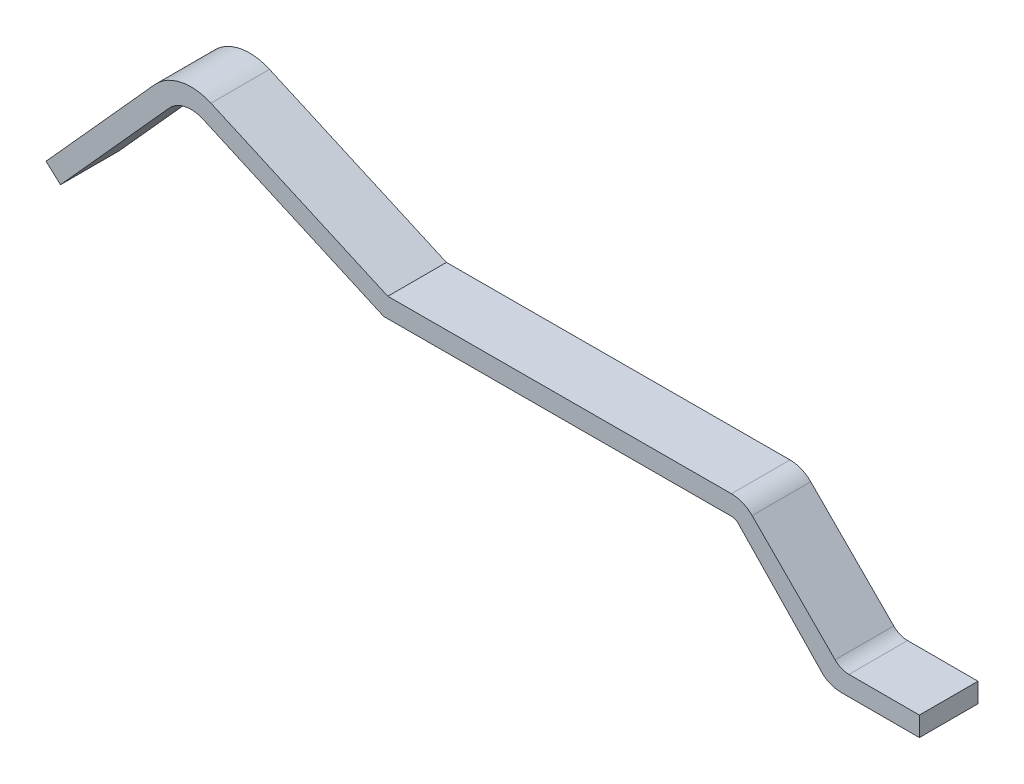
ISO-10303-21;
HEADER;
FILE_DESCRIPTION(('STEP AP214'),'2;1');
FILE_NAME('part.step','',(''),(''),'','','');
FILE_SCHEMA(('AUTOMOTIVE_DESIGN { 1 0 10303 214 1 1 1 1 }'));
ENDSEC;
DATA;
#1=APPLICATION_CONTEXT('core data for automotive mechanical design processes');
#2=APPLICATION_PROTOCOL_DEFINITION('international standard','automotive_design',2000,#1);
#3=PRODUCT_CONTEXT('',#1,'mechanical');
#4=PRODUCT('Part','Part','',(#3));
#5=PRODUCT_RELATED_PRODUCT_CATEGORY('part','',(#4));
#6=PRODUCT_DEFINITION_FORMATION('','',#4);
#7=PRODUCT_DEFINITION_CONTEXT('part definition',#1,'design');
#8=PRODUCT_DEFINITION('design','',#6,#7);
#9=PRODUCT_DEFINITION_SHAPE('','',#8);
#10=(LENGTH_UNIT() NAMED_UNIT(*) SI_UNIT(.MILLI.,.METRE.));
#11=(NAMED_UNIT(*) PLANE_ANGLE_UNIT() SI_UNIT($,.RADIAN.));
#12=(NAMED_UNIT(*) SI_UNIT($,.STERADIAN.) SOLID_ANGLE_UNIT());
#13=UNCERTAINTY_MEASURE_WITH_UNIT(LENGTH_MEASURE(1.E-05),#10,'distance_accuracy_value','');
#14=(GEOMETRIC_REPRESENTATION_CONTEXT(3) GLOBAL_UNCERTAINTY_ASSIGNED_CONTEXT((#13)) GLOBAL_UNIT_ASSIGNED_CONTEXT((#10,
#11,#12)) REPRESENTATION_CONTEXT('',''));
#15=CARTESIAN_POINT('',(0.,0.,0.));
#16=DIRECTION('',(0.,0.,1.));
#17=DIRECTION('',(1.,0.,0.));
#18=AXIS2_PLACEMENT_3D('',#15,#16,#17);
#19=CARTESIAN_POINT('',(17.1707476581065,0.197947805161229,0.3));
#20=DIRECTION('',(0.,-1.,0.));
#21=DIRECTION('',(1.,0.,0.));
#22=AXIS2_PLACEMENT_3D('',#19,#20,#21);
#23=PLANE('',#22);
#24=DIRECTION('',(0.,0.,-1.));
#25=VECTOR('',#24,1.);
#26=CARTESIAN_POINT('',(17.1707476581065,0.197947805161225,0.3));
#27=LINE('',#26,#25);
#28=CARTESIAN_POINT('',(17.1707476581065,0.197947805161225,-0.3));
#29=VERTEX_POINT('',#28);
#30=CARTESIAN_POINT('',(17.1707476581065,0.197947805161225,0.3));
#31=VERTEX_POINT('',#30);
#32=EDGE_CURVE('E232',#29,#31,#27,.F.);
#33=ORIENTED_EDGE('',*,*,#32,.T.);
#34=DIRECTION('',(-1.,0.,0.));
#35=VECTOR('',#34,1.);
#36=CARTESIAN_POINT('',(17.0917527563786,0.197947805161225,0.3));
#37=LINE('',#36,#35);
#38=CARTESIAN_POINT('',(17.8917527563786,0.197947805161227,0.3));
#39=VERTEX_POINT('',#38);
#40=EDGE_CURVE('E188',#31,#39,#37,.F.);
#41=ORIENTED_EDGE('',*,*,#40,.T.);
#42=DIRECTION('',(0.,0.,1.));
#43=VECTOR('',#42,1.);
#44=CARTESIAN_POINT('',(17.8917527563786,0.197947805161229,0.3));
#45=LINE('',#44,#43);
#46=CARTESIAN_POINT('',(17.8917527563786,0.197947805161226,-0.3));
#47=VERTEX_POINT('',#46);
#48=EDGE_CURVE('E276',#39,#47,#45,.F.);
#49=ORIENTED_EDGE('',*,*,#48,.T.);
#50=DIRECTION('',(-1.,0.,0.));
#51=VECTOR('',#50,1.);
#52=CARTESIAN_POINT('',(17.0917527563786,0.197947805161225,-0.3));
#53=LINE('',#52,#51);
#54=EDGE_CURVE('E271',#29,#47,#53,.F.);
#55=ORIENTED_EDGE('',*,*,#54,.F.);
#56=EDGE_LOOP('',(#33,#41,#49,#55));
#57=FACE_BOUND('',#56,.T.);
#58=ADVANCED_FACE('F17',(#57),#23,.F.);
#59=CARTESIAN_POINT('',(17.8917527563786,0.197947805161229,0.3));
#60=DIRECTION('',(-1.,0.,0.));
#61=DIRECTION('',(0.,0.,1.));
#62=AXIS2_PLACEMENT_3D('',#59,#60,#61);
#63=PLANE('',#62);
#64=ORIENTED_EDGE('',*,*,#48,.F.);
#65=DIRECTION('',(0.,1.,0.));
#66=VECTOR('',#65,1.);
#67=CARTESIAN_POINT('',(17.8917527563786,0.297947805161533,0.3));
#68=LINE('',#67,#66);
#69=CARTESIAN_POINT('',(17.8917527563786,-0.00205219483882492,0.3));
#70=VERTEX_POINT('',#69);
#71=EDGE_CURVE('E226',#39,#70,#68,.F.);
#72=ORIENTED_EDGE('',*,*,#71,.T.);
#73=DIRECTION('',(0.,0.,1.));
#74=VECTOR('',#73,1.);
#75=CARTESIAN_POINT('',(17.8917527563786,-0.00205219483882491,0.3));
#76=LINE('',#75,#74);
#77=CARTESIAN_POINT('',(17.8917527563786,-0.00205219483882492,-0.3));
#78=VERTEX_POINT('',#77);
#79=EDGE_CURVE('E97',#70,#78,#76,.F.);
#80=ORIENTED_EDGE('',*,*,#79,.T.);
#81=DIRECTION('',(0.,1.,0.));
#82=VECTOR('',#81,1.);
#83=CARTESIAN_POINT('',(17.8917527563786,0.297947805161533,-0.3));
#84=LINE('',#83,#82);
#85=EDGE_CURVE('E279',#47,#78,#84,.F.);
#86=ORIENTED_EDGE('',*,*,#85,.F.);
#87=EDGE_LOOP('',(#64,#72,#80,#86));
#88=FACE_BOUND('',#87,.T.);
#89=ADVANCED_FACE('F343',(#88),#63,.F.);
#90=CARTESIAN_POINT('',(17.8917527563786,-0.00205219483882491,0.3));
#91=DIRECTION('',(0.,1.,0.));
#92=DIRECTION('',(-1.,0.,0.));
#93=AXIS2_PLACEMENT_3D('',#90,#91,#92);
#94=PLANE('',#93);
#95=ORIENTED_EDGE('',*,*,#79,.F.);
#96=DIRECTION('',(-1.,0.,0.));
#97=VECTOR('',#96,1.);
#98=CARTESIAN_POINT('',(17.0917527563786,-0.00205219483882492,0.3));
#99=LINE('',#98,#97);
#100=CARTESIAN_POINT('',(17.0917527563786,-0.00205219483882557,0.3));
#101=VERTEX_POINT('',#100);
#102=EDGE_CURVE('E224',#70,#101,#99,.T.);
#103=ORIENTED_EDGE('',*,*,#102,.T.);
#104=DIRECTION('',(0.,0.,-1.));
#105=VECTOR('',#104,1.);
#106=CARTESIAN_POINT('',(17.0917527563786,-0.00205219483882623,0.3));
#107=LINE('',#106,#105);
#108=CARTESIAN_POINT('',(17.0917527563786,-0.00205219483882557,-0.3));
#109=VERTEX_POINT('',#108);
#110=EDGE_CURVE('E87',#109,#101,#107,.F.);
#111=ORIENTED_EDGE('',*,*,#110,.F.);
#112=DIRECTION('',(-1.,0.,0.));
#113=VECTOR('',#112,1.);
#114=CARTESIAN_POINT('',(17.0917527563786,-0.00205219483882492,-0.3));
#115=LINE('',#114,#113);
#116=EDGE_CURVE('E282',#78,#109,#115,.T.);
#117=ORIENTED_EDGE('',*,*,#116,.F.);
#118=EDGE_LOOP('',(#95,#103,#111,#117));
#119=FACE_BOUND('',#118,.T.);
#120=ADVANCED_FACE('F344',(#119),#94,.F.);
#121=CARTESIAN_POINT('',(17.0917527563786,0.297947805161533,0.3));
#122=DIRECTION('',(0.,0.,-1.));
#123=DIRECTION('',(-1.,0.,0.));
#124=AXIS2_PLACEMENT_3D('',#121,#122,#123);
#125=CYLINDRICAL_SURFACE('',#124,0.300000000000359);
#126=CARTESIAN_POINT('',(17.0917527563786,0.297947805161533,0.3));
#127=DIRECTION('',(0.,0.,-1.));
#128=DIRECTION('',(-1.,0.,0.));
#129=AXIS2_PLACEMENT_3D('',#126,#127,#128);
#130=CIRCLE('',#129,0.300000000000359);
#131=CARTESIAN_POINT('',(16.9117527563786,0.0579478051610852,0.3));
#132=VERTEX_POINT('',#131);
#133=EDGE_CURVE('E20',#101,#132,#130,.T.);
#134=ORIENTED_EDGE('',*,*,#133,.T.);
#135=DIRECTION('',(0.,0.,1.));
#136=VECTOR('',#135,1.);
#137=CARTESIAN_POINT('',(16.9117527563786,0.0579478051610878,0.3));
#138=LINE('',#137,#136);
#139=CARTESIAN_POINT('',(16.9117527563786,0.0579478051610852,-0.3));
#140=VERTEX_POINT('',#139);
#141=EDGE_CURVE('E160',#132,#140,#138,.F.);
#142=ORIENTED_EDGE('',*,*,#141,.T.);
#143=CARTESIAN_POINT('',(17.0917527563786,0.297947805161533,-0.3));
#144=DIRECTION('',(0.,0.,-1.));
#145=DIRECTION('',(-1.,0.,0.));
#146=AXIS2_PLACEMENT_3D('',#143,#144,#145);
#147=CIRCLE('',#146,0.300000000000359);
#148=EDGE_CURVE('E306',#109,#140,#147,.T.);
#149=ORIENTED_EDGE('',*,*,#148,.F.);
#150=ORIENTED_EDGE('',*,*,#110,.T.);
#151=EDGE_LOOP('',(#134,#142,#149,#150));
#152=FACE_BOUND('',#151,.T.);
#153=ADVANCED_FACE('F346',(#152),#125,.T.);
#154=CARTESIAN_POINT('',(16.9117527563786,0.0579478051610878,0.3));
#155=DIRECTION('',(0.72171309209664,0.692192323488427,0.));
#156=DIRECTION('',(-0.692192323488427,0.72171309209664,0.));
#157=AXIS2_PLACEMENT_3D('',#154,#155,#156);
#158=PLANE('',#157);
#159=ORIENTED_EDGE('',*,*,#141,.F.);
#160=DIRECTION('',(-0.692192323488427,0.72171309209664,0.));
#161=VECTOR('',#160,1.);
#162=CARTESIAN_POINT('',(16.9117527563786,0.0579478051610877,0.3));
#163=LINE('',#162,#161);
#164=CARTESIAN_POINT('',(16.0381993657855,0.968756690557452,0.3));
#165=VERTEX_POINT('',#164);
#166=EDGE_CURVE('E172',#132,#165,#163,.T.);
#167=ORIENTED_EDGE('',*,*,#166,.T.);
#168=DIRECTION('',(0.,0.,-1.));
#169=VECTOR('',#168,1.);
#170=CARTESIAN_POINT('',(16.0381993657854,0.9687566905576,0.3));
#171=LINE('',#170,#169);
#172=CARTESIAN_POINT('',(16.0381993657855,0.968756690557452,-0.3));
#173=VERTEX_POINT('',#172);
#174=EDGE_CURVE('E268',#165,#173,#171,.T.);
#175=ORIENTED_EDGE('',*,*,#174,.T.);
#176=DIRECTION('',(-0.692192323488427,0.72171309209664,0.));
#177=VECTOR('',#176,1.);
#178=CARTESIAN_POINT('',(16.9117527563786,0.0579478051610877,-0.3));
#179=LINE('',#178,#177);
#180=EDGE_CURVE('E305',#140,#173,#179,.T.);
#181=ORIENTED_EDGE('',*,*,#180,.F.);
#182=EDGE_LOOP('',(#159,#167,#175,#181));
#183=FACE_BOUND('',#182,.T.);
#184=ADVANCED_FACE('F349',(#183),#158,.F.);
#185=CARTESIAN_POINT('',(12.407488687666,0.99,0.3));
#186=DIRECTION('',(0.40673664307565,0.913545457642668,0.));
#187=DIRECTION('',(-0.913545457642668,0.40673664307565,0.));
#188=AXIS2_PLACEMENT_3D('',#185,#186,#187);
#189=PLANE('',#188);
#190=DIRECTION('',(0.,0.,1.));
#191=VECTOR('',#190,1.);
#192=CARTESIAN_POINT('',(12.407488687666,0.99,0.3));
#193=LINE('',#192,#191);
#194=CARTESIAN_POINT('',(12.407488687666,0.99,0.3));
#195=VERTEX_POINT('',#194);
#196=CARTESIAN_POINT('',(12.407488687666,0.99,-0.3));
#197=VERTEX_POINT('',#196);
#198=EDGE_CURVE('E151',#195,#197,#193,.F.);
#199=ORIENTED_EDGE('',*,*,#198,.F.);
#200=DIRECTION('',(-0.913545457642668,0.40673664307565,0.));
#201=VECTOR('',#200,1.);
#202=CARTESIAN_POINT('',(12.407488687666,0.99,0.3));
#203=LINE('',#202,#201);
#204=CARTESIAN_POINT('',(10.5579715524435,1.81345808257036,0.3));
#205=VERTEX_POINT('',#204);
#206=EDGE_CURVE('E155',#195,#205,#203,.T.);
#207=ORIENTED_EDGE('',*,*,#206,.T.);
#208=DIRECTION('',(0.,0.,-1.));
#209=VECTOR('',#208,1.);
#210=CARTESIAN_POINT('',(10.5579715524435,1.81345808257035,0.3));
#211=LINE('',#210,#209);
#212=CARTESIAN_POINT('',(10.5579715524435,1.81345808257036,-0.3));
#213=VERTEX_POINT('',#212);
#214=EDGE_CURVE('E159',#205,#213,#211,.T.);
#215=ORIENTED_EDGE('',*,*,#214,.T.);
#216=DIRECTION('',(-0.913545457642668,0.40673664307565,0.));
#217=VECTOR('',#216,1.);
#218=CARTESIAN_POINT('',(12.407488687666,0.99,-0.3));
#219=LINE('',#218,#217);
#220=EDGE_CURVE('E156',#197,#213,#219,.T.);
#221=ORIENTED_EDGE('',*,*,#220,.F.);
#222=EDGE_LOOP('',(#199,#207,#215,#221));
#223=FACE_BOUND('',#222,.T.);
#224=ADVANCED_FACE('F153',(#223),#189,.F.);
#225=CARTESIAN_POINT('',(10.4359505595208,1.53939444527741,0.3));
#226=DIRECTION('',(0.,0.,-1.));
#227=DIRECTION('',(-1.,0.,0.));
#228=AXIS2_PLACEMENT_3D('',#225,#226,#227);
#229=CYLINDRICAL_SURFACE('',#228,0.300000000000163);
#230=ORIENTED_EDGE('',*,*,#214,.F.);
#231=CARTESIAN_POINT('',(10.4359505595208,1.53939444527741,0.3));
#232=DIRECTION('',(0.,0.,-1.));
#233=DIRECTION('',(-1.,0.,0.));
#234=AXIS2_PLACEMENT_3D('',#231,#232,#233);
#235=CIRCLE('',#234,0.300000000000163);
#236=CARTESIAN_POINT('',(10.2130071118774,1.74013362718514,0.3));
#237=VERTEX_POINT('',#236);
#238=EDGE_CURVE('E171',#205,#237,#235,.F.);
#239=ORIENTED_EDGE('',*,*,#238,.T.);
#240=DIRECTION('',(0.,0.,1.));
#241=VECTOR('',#240,1.);
#242=CARTESIAN_POINT('',(10.2130071118774,1.74013362718514,0.3));
#243=LINE('',#242,#241);
#244=CARTESIAN_POINT('',(10.2130071118774,1.74013362718514,-0.3));
#245=VERTEX_POINT('',#244);
#246=EDGE_CURVE('E261',#237,#245,#243,.F.);
#247=ORIENTED_EDGE('',*,*,#246,.T.);
#248=CARTESIAN_POINT('',(10.4359505595208,1.53939444527741,-0.3));
#249=DIRECTION('',(0.,0.,-1.));
#250=DIRECTION('',(-1.,0.,0.));
#251=AXIS2_PLACEMENT_3D('',#248,#249,#250);
#252=CIRCLE('',#251,0.300000000000163);
#253=EDGE_CURVE('E134',#213,#245,#252,.F.);
#254=ORIENTED_EDGE('',*,*,#253,.F.);
#255=EDGE_LOOP('',(#230,#239,#247,#254));
#256=FACE_BOUND('',#255,.T.);
#257=ADVANCED_FACE('F315',(#256),#229,.F.);
#258=CARTESIAN_POINT('',(10.2130071118774,1.74013362718514,0.3));
#259=DIRECTION('',(-0.743144825477495,0.669130606358746,0.));
#260=DIRECTION('',(-0.669130606358746,-0.743144825477495,0.));
#261=AXIS2_PLACEMENT_3D('',#258,#259,#260);
#262=PLANE('',#261);
#263=ORIENTED_EDGE('',*,*,#246,.F.);
#264=DIRECTION('',(-0.669130606358745,-0.743144825477496,0.));
#265=VECTOR('',#264,1.);
#266=CARTESIAN_POINT('',(10.2130071118774,1.74013362718514,0.3));
#267=LINE('',#266,#265);
#268=CARTESIAN_POINT('',(9.09953182556442,0.503494039252559,0.3));
#269=VERTEX_POINT('',#268);
#270=EDGE_CURVE('E216',#237,#269,#267,.T.);
#271=ORIENTED_EDGE('',*,*,#270,.T.);
#272=DIRECTION('',(0.,0.,1.));
#273=VECTOR('',#272,1.);
#274=CARTESIAN_POINT('',(9.09953182556442,0.50349403925256,0.3));
#275=LINE('',#274,#273);
#276=CARTESIAN_POINT('',(9.09953182556442,0.503494039252559,-0.3));
#277=VERTEX_POINT('',#276);
#278=EDGE_CURVE('E252',#269,#277,#275,.F.);
#279=ORIENTED_EDGE('',*,*,#278,.T.);
#280=DIRECTION('',(-0.669130606358745,-0.743144825477496,0.));
#281=VECTOR('',#280,1.);
#282=CARTESIAN_POINT('',(10.2130071118774,1.74013362718514,-0.3));
#283=LINE('',#282,#281);
#284=EDGE_CURVE('E139',#245,#277,#283,.T.);
#285=ORIENTED_EDGE('',*,*,#284,.F.);
#286=EDGE_LOOP('',(#263,#271,#279,#285));
#287=FACE_BOUND('',#286,.T.);
#288=ADVANCED_FACE('F317',(#287),#262,.F.);
#289=CARTESIAN_POINT('',(9.09953182556442,0.50349403925256,0.3));
#290=DIRECTION('',(0.669130606358746,0.743144825477495,0.));
#291=DIRECTION('',(-0.743144825477495,0.669130606358746,0.));
#292=AXIS2_PLACEMENT_3D('',#289,#290,#291);
#293=PLANE('',#292);
#294=ORIENTED_EDGE('',*,*,#278,.F.);
#295=DIRECTION('',(-0.743144825477496,0.669130606358746,0.));
#296=VECTOR('',#295,1.);
#297=CARTESIAN_POINT('',(9.09953182556442,0.50349403925256,0.3));
#298=LINE('',#297,#296);
#299=CARTESIAN_POINT('',(8.95090286046869,0.63732016052452,0.3));
#300=VERTEX_POINT('',#299);
#301=EDGE_CURVE('E213',#269,#300,#298,.T.);
#302=ORIENTED_EDGE('',*,*,#301,.T.);
#303=DIRECTION('',(0.,0.,1.));
#304=VECTOR('',#303,1.);
#305=CARTESIAN_POINT('',(8.95090286046869,0.63732016052452,0.3));
#306=LINE('',#305,#304);
#307=CARTESIAN_POINT('',(8.95090286046869,0.63732016052452,-0.3));
#308=VERTEX_POINT('',#307);
#309=EDGE_CURVE('E249',#300,#308,#306,.F.);
#310=ORIENTED_EDGE('',*,*,#309,.T.);
#311=DIRECTION('',(-0.743144825477496,0.669130606358746,0.));
#312=VECTOR('',#311,1.);
#313=CARTESIAN_POINT('',(9.09953182556442,0.50349403925256,-0.3));
#314=LINE('',#313,#312);
#315=EDGE_CURVE('E255',#277,#308,#314,.T.);
#316=ORIENTED_EDGE('',*,*,#315,.F.);
#317=EDGE_LOOP('',(#294,#302,#310,#316));
#318=FACE_BOUND('',#317,.T.);
#319=ADVANCED_FACE('F387',(#318),#293,.F.);
#320=CARTESIAN_POINT('',(8.95090286046869,0.63732016052452,0.3));
#321=DIRECTION('',(0.743144825477361,-0.669130606358895,0.));
#322=DIRECTION('',(0.669130606358895,0.743144825477361,0.));
#323=AXIS2_PLACEMENT_3D('',#320,#321,#322);
#324=PLANE('',#323);
#325=ORIENTED_EDGE('',*,*,#309,.F.);
#326=DIRECTION('',(0.669130606358895,0.743144825477361,0.));
#327=VECTOR('',#326,1.);
#328=CARTESIAN_POINT('',(8.95090286046869,0.63732016052452,0.3));
#329=LINE('',#328,#327);
#330=CARTESIAN_POINT('',(10.064378146782,1.87395974845693,0.3));
#331=VERTEX_POINT('',#330);
#332=EDGE_CURVE('E210',#300,#331,#329,.T.);
#333=ORIENTED_EDGE('',*,*,#332,.T.);
#334=DIRECTION('',(0.,0.,-1.));
#335=VECTOR('',#334,1.);
#336=CARTESIAN_POINT('',(10.0643781467819,1.87395974845692,0.3));
#337=LINE('',#336,#335);
#338=CARTESIAN_POINT('',(10.064378146782,1.87395974845693,-0.3));
#339=VERTEX_POINT('',#338);
#340=EDGE_CURVE('E247',#339,#331,#337,.F.);
#341=ORIENTED_EDGE('',*,*,#340,.F.);
#342=DIRECTION('',(0.669130606358895,0.743144825477361,0.));
#343=VECTOR('',#342,1.);
#344=CARTESIAN_POINT('',(8.95090286046869,0.63732016052452,-0.3));
#345=LINE('',#344,#343);
#346=EDGE_CURVE('E257',#308,#339,#345,.T.);
#347=ORIENTED_EDGE('',*,*,#346,.F.);
#348=EDGE_LOOP('',(#325,#333,#341,#347));
#349=FACE_BOUND('',#348,.T.);
#350=ADVANCED_FACE('F384',(#349),#324,.F.);
#351=CARTESIAN_POINT('',(10.4359505595208,1.53939444527736,0.3));
#352=DIRECTION('',(0.,0.,-1.));
#353=DIRECTION('',(-1.,0.,0.));
#354=AXIS2_PLACEMENT_3D('',#351,#352,#353);
#355=CYLINDRICAL_SURFACE('',#354,0.50000000000019);
#356=CARTESIAN_POINT('',(10.4359505595208,1.53939444527736,0.3));
#357=DIRECTION('',(0.,0.,-1.));
#358=DIRECTION('',(-1.,0.,0.));
#359=AXIS2_PLACEMENT_3D('',#356,#357,#358);
#360=CIRCLE('',#359,0.50000000000019);
#361=CARTESIAN_POINT('',(10.6393188810587,1.99616717409889,0.3));
#362=VERTEX_POINT('',#361);
#363=EDGE_CURVE('E207',#331,#362,#360,.T.);
#364=ORIENTED_EDGE('',*,*,#363,.T.);
#365=DIRECTION('',(0.,0.,1.));
#366=VECTOR('',#365,1.);
#367=CARTESIAN_POINT('',(10.6393188810586,1.9961671740989,0.3));
#368=LINE('',#367,#366);
#369=CARTESIAN_POINT('',(10.6393188810587,1.99616717409889,-0.3));
#370=VERTEX_POINT('',#369);
#371=EDGE_CURVE('E242',#362,#370,#368,.F.);
#372=ORIENTED_EDGE('',*,*,#371,.T.);
#373=CARTESIAN_POINT('',(10.4359505595208,1.53939444527736,-0.3));
#374=DIRECTION('',(0.,0.,-1.));
#375=DIRECTION('',(-1.,0.,0.));
#376=AXIS2_PLACEMENT_3D('',#373,#374,#375);
#377=CIRCLE('',#376,0.50000000000019);
#378=EDGE_CURVE('E300',#339,#370,#377,.T.);
#379=ORIENTED_EDGE('',*,*,#378,.F.);
#380=ORIENTED_EDGE('',*,*,#340,.T.);
#381=EDGE_LOOP('',(#364,#372,#379,#380));
#382=FACE_BOUND('',#381,.T.);
#383=ADVANCED_FACE('F378',(#382),#355,.T.);
#384=CARTESIAN_POINT('',(10.6393188810586,1.9961671740989,0.3));
#385=DIRECTION('',(-0.40673664307565,-0.913545457642668,0.));
#386=DIRECTION('',(0.913545457642668,-0.40673664307565,0.));
#387=AXIS2_PLACEMENT_3D('',#384,#385,#386);
#388=PLANE('',#387);
#389=ORIENTED_EDGE('',*,*,#371,.F.);
#390=DIRECTION('',(0.913545457642668,-0.406736643075651,0.));
#391=VECTOR('',#390,1.);
#392=CARTESIAN_POINT('',(10.6393188810586,1.9961671740989,0.3));
#393=LINE('',#392,#391);
#394=CARTESIAN_POINT('',(12.45,1.19000000000001,0.3));
#395=VERTEX_POINT('',#394);
#396=EDGE_CURVE('E202',#362,#395,#393,.T.);
#397=ORIENTED_EDGE('',*,*,#396,.T.);
#398=DIRECTION('',(0.,0.,1.));
#399=VECTOR('',#398,1.);
#400=CARTESIAN_POINT('',(12.45,1.19000000000001,0.3));
#401=LINE('',#400,#399);
#402=CARTESIAN_POINT('',(12.45,1.19000000000001,-0.3));
#403=VERTEX_POINT('',#402);
#404=EDGE_CURVE('E239',#395,#403,#401,.F.);
#405=ORIENTED_EDGE('',*,*,#404,.T.);
#406=DIRECTION('',(0.913545457642668,-0.406736643075651,0.));
#407=VECTOR('',#406,1.);
#408=CARTESIAN_POINT('',(10.6393188810586,1.9961671740989,-0.3));
#409=LINE('',#408,#407);
#410=EDGE_CURVE('E302',#370,#403,#409,.T.);
#411=ORIENTED_EDGE('',*,*,#410,.F.);
#412=EDGE_LOOP('',(#389,#397,#405,#411));
#413=FACE_BOUND('',#412,.T.);
#414=ADVANCED_FACE('F373',(#413),#388,.F.);
#415=CARTESIAN_POINT('',(12.45,1.19000000000001,0.3));
#416=DIRECTION('',(0.00225950545359394,-0.999997447314295,0.));
#417=DIRECTION('',(0.999997447314295,0.00225950545359394,0.));
#418=AXIS2_PLACEMENT_3D('',#415,#416,#417);
#419=PLANE('',#418);
#420=ORIENTED_EDGE('',*,*,#404,.F.);
#421=DIRECTION('',(0.999997447314295,0.00225950545359387,0.));
#422=VECTOR('',#421,1.);
#423=CARTESIAN_POINT('',(12.45,1.19000000000001,0.3));
#424=LINE('',#423,#422);
#425=CARTESIAN_POINT('',(15.9674886876667,1.197947805161,0.3));
#426=VERTEX_POINT('',#425);
#427=EDGE_CURVE('E199',#395,#426,#424,.T.);
#428=ORIENTED_EDGE('',*,*,#427,.T.);
#429=DIRECTION('',(0.,0.,-1.));
#430=VECTOR('',#429,1.);
#431=CARTESIAN_POINT('',(15.9674886876667,1.197947805161,0.3));
#432=LINE('',#431,#430);
#433=CARTESIAN_POINT('',(15.9674886876667,1.197947805161,-0.3));
#434=VERTEX_POINT('',#433);
#435=EDGE_CURVE('E237',#434,#426,#432,.F.);
#436=ORIENTED_EDGE('',*,*,#435,.F.);
#437=DIRECTION('',(0.999997447314295,0.00225950545359387,0.));
#438=VECTOR('',#437,1.);
#439=CARTESIAN_POINT('',(12.45,1.19000000000001,-0.3));
#440=LINE('',#439,#438);
#441=EDGE_CURVE('E299',#403,#434,#440,.T.);
#442=ORIENTED_EDGE('',*,*,#441,.F.);
#443=EDGE_LOOP('',(#420,#428,#436,#442));
#444=FACE_BOUND('',#443,.T.);
#445=ADVANCED_FACE('F368',(#444),#419,.F.);
#446=CARTESIAN_POINT('',(15.968162863443,0.899575409463471,0.3));
#447=DIRECTION('',(0.,0.,-1.));
#448=DIRECTION('',(-1.,0.,0.));
#449=AXIS2_PLACEMENT_3D('',#446,#447,#448);
#450=CYLINDRICAL_SURFACE('',#449,0.298373157350418);
#451=CARTESIAN_POINT('',(15.968162863443,0.899575409463471,0.3));
#452=DIRECTION('',(0.,0.,-1.));
#453=DIRECTION('',(-1.,0.,0.));
#454=AXIS2_PLACEMENT_3D('',#451,#452,#453);
#455=CIRCLE('',#454,0.298373157350418);
#456=CARTESIAN_POINT('',(16.1796207220227,1.11007983951695,0.3));
#457=VERTEX_POINT('',#456);
#458=EDGE_CURVE('E198',#426,#457,#455,.T.);
#459=ORIENTED_EDGE('',*,*,#458,.T.);
#460=DIRECTION('',(0.,0.,1.));
#461=VECTOR('',#460,1.);
#462=CARTESIAN_POINT('',(16.1796207220227,1.11007983951695,0.3));
#463=LINE('',#462,#461);
#464=CARTESIAN_POINT('',(16.1796207220227,1.11007983951695,-0.3));
#465=VERTEX_POINT('',#464);
#466=EDGE_CURVE('E234',#457,#465,#463,.F.);
#467=ORIENTED_EDGE('',*,*,#466,.T.);
#468=CARTESIAN_POINT('',(15.968162863443,0.899575409463471,-0.3));
#469=DIRECTION('',(0.,0.,-1.));
#470=DIRECTION('',(-1.,0.,0.));
#471=AXIS2_PLACEMENT_3D('',#468,#469,#470);
#472=CIRCLE('',#471,0.298373157350418);
#473=EDGE_CURVE('E297',#434,#465,#472,.T.);
#474=ORIENTED_EDGE('',*,*,#473,.F.);
#475=ORIENTED_EDGE('',*,*,#435,.T.);
#476=EDGE_LOOP('',(#459,#467,#474,#475));
#477=FACE_BOUND('',#476,.T.);
#478=ADVANCED_FACE('F362',(#477),#450,.T.);
#479=CARTESIAN_POINT('',(16.1796207220227,1.11007983951695,0.3));
#480=DIRECTION('',(-0.708702687793621,-0.705507264536728,0.));
#481=DIRECTION('',(0.705507264536728,-0.708702687793621,0.));
#482=AXIS2_PLACEMENT_3D('',#479,#480,#481);
#483=PLANE('',#482);
#484=ORIENTED_EDGE('',*,*,#466,.F.);
#485=DIRECTION('',(0.705507264536728,-0.708702687793621,0.));
#486=VECTOR('',#485,1.);
#487=CARTESIAN_POINT('',(16.1796207220227,1.11007983951695,0.3));
#488=LINE('',#487,#486);
#489=CARTESIAN_POINT('',(17.0290071205478,0.256846352253877,0.3));
#490=VERTEX_POINT('',#489);
#491=EDGE_CURVE('E195',#457,#490,#488,.T.);
#492=ORIENTED_EDGE('',*,*,#491,.T.);
#493=DIRECTION('',(0.,0.,-1.));
#494=VECTOR('',#493,1.);
#495=CARTESIAN_POINT('',(17.0290071205478,0.256846352253878,0.3));
#496=LINE('',#495,#494);
#497=CARTESIAN_POINT('',(17.0290071205478,0.256846352253877,-0.3));
#498=VERTEX_POINT('',#497);
#499=EDGE_CURVE('E229',#490,#498,#496,.T.);
#500=ORIENTED_EDGE('',*,*,#499,.T.);
#501=DIRECTION('',(0.705507264536728,-0.708702687793621,0.));
#502=VECTOR('',#501,1.);
#503=CARTESIAN_POINT('',(16.1796207220227,1.11007983951695,-0.3));
#504=LINE('',#503,#502);
#505=EDGE_CURVE('E181',#465,#498,#504,.T.);
#506=ORIENTED_EDGE('',*,*,#505,.F.);
#507=EDGE_LOOP('',(#484,#492,#500,#506));
#508=FACE_BOUND('',#507,.T.);
#509=ADVANCED_FACE('F358',(#508),#483,.F.);
#510=CARTESIAN_POINT('',(17.1707476581065,0.397947805161221,0.3));
#511=DIRECTION('',(0.,0.,-1.));
#512=DIRECTION('',(-1.,0.,0.));
#513=AXIS2_PLACEMENT_3D('',#510,#511,#512);
#514=CYLINDRICAL_SURFACE('',#513,0.199999999999995);
#515=ORIENTED_EDGE('',*,*,#499,.F.);
#516=CARTESIAN_POINT('',(17.1707476581065,0.397947805161221,0.3));
#517=DIRECTION('',(0.,0.,-1.));
#518=DIRECTION('',(-1.,0.,0.));
#519=AXIS2_PLACEMENT_3D('',#516,#517,#518);
#520=CIRCLE('',#519,0.199999999999995);
#521=EDGE_CURVE('E192',#490,#31,#520,.F.);
#522=ORIENTED_EDGE('',*,*,#521,.T.);
#523=ORIENTED_EDGE('',*,*,#32,.F.);
#524=CARTESIAN_POINT('',(17.1707476581065,0.397947805161221,-0.3));
#525=DIRECTION('',(0.,0.,-1.));
#526=DIRECTION('',(-1.,0.,0.));
#527=AXIS2_PLACEMENT_3D('',#524,#525,#526);
#528=CIRCLE('',#527,0.199999999999995);
#529=EDGE_CURVE('E177',#498,#29,#528,.F.);
#530=ORIENTED_EDGE('',*,*,#529,.F.);
#531=EDGE_LOOP('',(#515,#522,#523,#530));
#532=FACE_BOUND('',#531,.T.);
#533=ADVANCED_FACE('F355',(#532),#514,.F.);
#534=CARTESIAN_POINT('',(17.0917527563786,0.297947805161533,0.3));
#535=DIRECTION('',(0.,0.,-1.));
#536=DIRECTION('',(-1.,0.,0.));
#537=AXIS2_PLACEMENT_3D('',#534,#535,#536);
#538=PLANE('',#537);
#539=ORIENTED_EDGE('',*,*,#521,.F.);
#540=ORIENTED_EDGE('',*,*,#491,.F.);
#541=ORIENTED_EDGE('',*,*,#458,.F.);
#542=ORIENTED_EDGE('',*,*,#427,.F.);
#543=ORIENTED_EDGE('',*,*,#396,.F.);
#544=ORIENTED_EDGE('',*,*,#363,.F.);
#545=ORIENTED_EDGE('',*,*,#332,.F.);
#546=ORIENTED_EDGE('',*,*,#301,.F.);
#547=ORIENTED_EDGE('',*,*,#270,.F.);
#548=ORIENTED_EDGE('',*,*,#238,.F.);
#549=ORIENTED_EDGE('',*,*,#206,.F.);
#550=DIRECTION('',(-0.999997447314295,-0.00225950545358628,0.));
#551=VECTOR('',#550,1.);
#552=CARTESIAN_POINT('',(15.967488687666,0.998043859948213,0.3));
#553=LINE('',#552,#551);
#554=CARTESIAN_POINT('',(15.967488687666,0.998043859948213,0.3));
#555=VERTEX_POINT('',#554);
#556=EDGE_CURVE('E168',#195,#555,#553,.F.);
#557=ORIENTED_EDGE('',*,*,#556,.T.);
#558=CARTESIAN_POINT('',(15.9677134245142,0.898581265536285,0.3));
#559=DIRECTION('',(0.,0.,-1.));
#560=DIRECTION('',(-1.,0.,0.));
#561=AXIS2_PLACEMENT_3D('',#558,#559,#560);
#562=CIRCLE('',#561,0.0994628483093271);
#563=EDGE_CURVE('E191',#555,#165,#562,.T.);
#564=ORIENTED_EDGE('',*,*,#563,.T.);
#565=ORIENTED_EDGE('',*,*,#166,.F.);
#566=ORIENTED_EDGE('',*,*,#133,.F.);
#567=ORIENTED_EDGE('',*,*,#102,.F.);
#568=ORIENTED_EDGE('',*,*,#71,.F.);
#569=ORIENTED_EDGE('',*,*,#40,.F.);
#570=EDGE_LOOP('',(#539,#540,#541,#542,#543,#544,#545,#546,#547,#548,#549,#557,#564,#565,#566,
#567,#568,#569));
#571=FACE_BOUND('',#570,.T.);
#572=ADVANCED_FACE('F166',(#571),#538,.F.);
#573=CARTESIAN_POINT('',(15.9677134245142,0.898581265536285,0.3));
#574=DIRECTION('',(0.,0.,-1.));
#575=DIRECTION('',(-1.,0.,0.));
#576=AXIS2_PLACEMENT_3D('',#573,#574,#575);
#577=CYLINDRICAL_SURFACE('',#576,0.0994628483093271);
#578=ORIENTED_EDGE('',*,*,#174,.F.);
#579=ORIENTED_EDGE('',*,*,#563,.F.);
#580=DIRECTION('',(0.,0.,1.));
#581=VECTOR('',#580,1.);
#582=CARTESIAN_POINT('',(15.967488687666,0.998043859948213,0.3));
#583=LINE('',#582,#581);
#584=CARTESIAN_POINT('',(15.967488687666,0.998043859948213,-0.3));
#585=VERTEX_POINT('',#584);
#586=EDGE_CURVE('E26',#555,#585,#583,.F.);
#587=ORIENTED_EDGE('',*,*,#586,.T.);
#588=CARTESIAN_POINT('',(15.9677134245142,0.898581265536285,-0.3));
#589=DIRECTION('',(0.,0.,-1.));
#590=DIRECTION('',(-1.,0.,0.));
#591=AXIS2_PLACEMENT_3D('',#588,#589,#590);
#592=CIRCLE('',#591,0.0994628483093271);
#593=EDGE_CURVE('E34',#173,#585,#592,.F.);
#594=ORIENTED_EDGE('',*,*,#593,.F.);
#595=EDGE_LOOP('',(#578,#579,#587,#594));
#596=FACE_BOUND('',#595,.T.);
#597=ADVANCED_FACE('F352',(#596),#577,.F.);
#598=CARTESIAN_POINT('',(17.0917527563786,0.297947805161533,-0.3));
#599=DIRECTION('',(0.,0.,-1.));
#600=DIRECTION('',(-1.,0.,0.));
#601=AXIS2_PLACEMENT_3D('',#598,#599,#600);
#602=PLANE('',#601);
#603=ORIENTED_EDGE('',*,*,#505,.T.);
#604=ORIENTED_EDGE('',*,*,#529,.T.);
#605=ORIENTED_EDGE('',*,*,#54,.T.);
#606=ORIENTED_EDGE('',*,*,#85,.T.);
#607=ORIENTED_EDGE('',*,*,#116,.T.);
#608=ORIENTED_EDGE('',*,*,#148,.T.);
#609=ORIENTED_EDGE('',*,*,#180,.T.);
#610=ORIENTED_EDGE('',*,*,#593,.T.);
#611=DIRECTION('',(-0.999997447314295,-0.00225950545358628,0.));
#612=VECTOR('',#611,1.);
#613=CARTESIAN_POINT('',(15.967488687666,0.998043859948213,-0.3));
#614=LINE('',#613,#612);
#615=EDGE_CURVE('E11',#585,#197,#614,.T.);
#616=ORIENTED_EDGE('',*,*,#615,.T.);
#617=ORIENTED_EDGE('',*,*,#220,.T.);
#618=ORIENTED_EDGE('',*,*,#253,.T.);
#619=ORIENTED_EDGE('',*,*,#284,.T.);
#620=ORIENTED_EDGE('',*,*,#315,.T.);
#621=ORIENTED_EDGE('',*,*,#346,.T.);
#622=ORIENTED_EDGE('',*,*,#378,.T.);
#623=ORIENTED_EDGE('',*,*,#410,.T.);
#624=ORIENTED_EDGE('',*,*,#441,.T.);
#625=ORIENTED_EDGE('',*,*,#473,.T.);
#626=EDGE_LOOP('',(#603,#604,#605,#606,#607,#608,#609,#610,#616,#617,#618,#619,#620,#621,#622,
#623,#624,#625));
#627=FACE_BOUND('',#626,.T.);
#628=ADVANCED_FACE('F336',(#627),#602,.T.);
#629=CARTESIAN_POINT('',(15.967488687666,0.998043859948213,0.3));
#630=DIRECTION('',(-0.00225950545358628,0.999997447314295,0.));
#631=DIRECTION('',(-0.999997447314295,-0.00225950545358628,0.));
#632=AXIS2_PLACEMENT_3D('',#629,#630,#631);
#633=PLANE('',#632);
#634=ORIENTED_EDGE('',*,*,#586,.F.);
#635=ORIENTED_EDGE('',*,*,#556,.F.);
#636=ORIENTED_EDGE('',*,*,#198,.T.);
#637=ORIENTED_EDGE('',*,*,#615,.F.);
#638=EDGE_LOOP('',(#634,#635,#636,#637));
#639=FACE_BOUND('',#638,.T.);
#640=ADVANCED_FACE('F175',(#639),#633,.F.);
#641=CLOSED_SHELL('',(#58,#89,#120,#153,#184,#224,#257,#288,#319,#350,#383,#414,#445,#478,#509,
#533,#572,#597,#628,#640));
#642=MANIFOLD_SOLID_BREP('B1',#641);
#643=ADVANCED_BREP_SHAPE_REPRESENTATION('',(#18,#642),#14);
#644=SHAPE_DEFINITION_REPRESENTATION(#9,#643);
ENDSEC;
END-ISO-10303-21;
